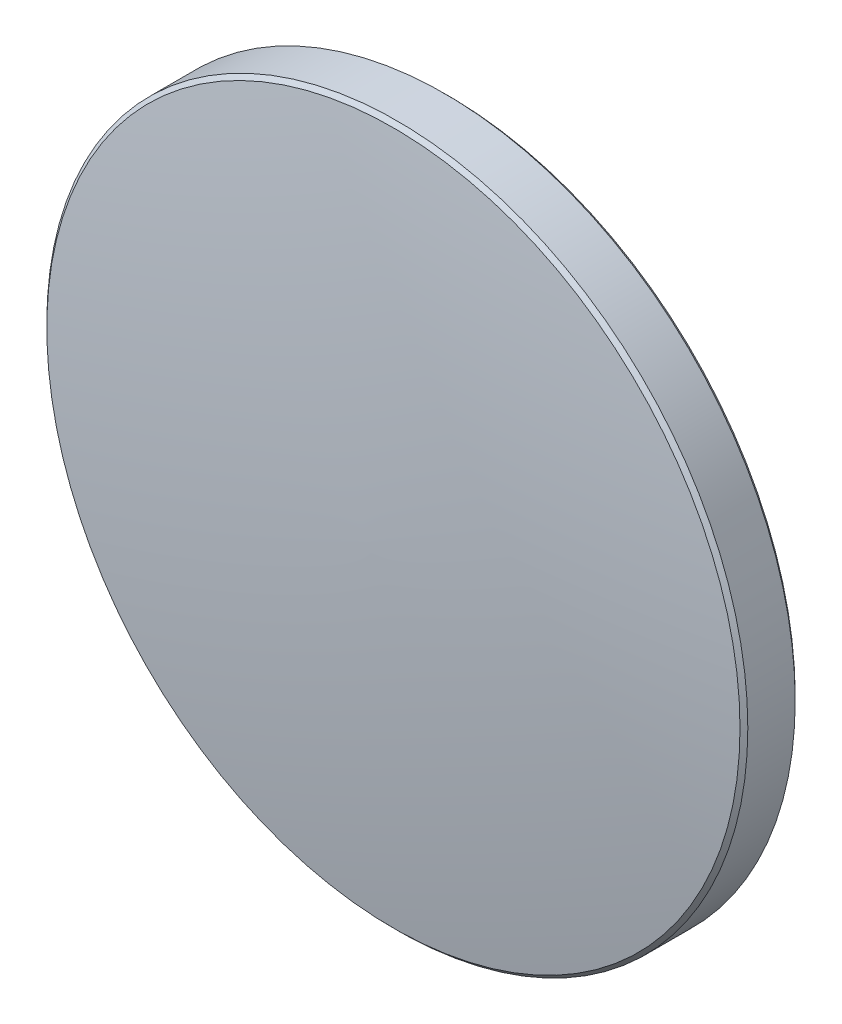
ISO-10303-21;
HEADER;
FILE_DESCRIPTION(('STEP AP214'),'2;1');
FILE_NAME('part.step','',(''),(''),'','','');
FILE_SCHEMA(('AUTOMOTIVE_DESIGN { 1 0 10303 214 1 1 1 1 }'));
ENDSEC;
DATA;
#1=APPLICATION_CONTEXT('core data for automotive mechanical design processes');
#2=APPLICATION_PROTOCOL_DEFINITION('international standard','automotive_design',2000,#1);
#3=PRODUCT_CONTEXT('',#1,'mechanical');
#4=PRODUCT('Part','Part','',(#3));
#5=PRODUCT_RELATED_PRODUCT_CATEGORY('part','',(#4));
#6=PRODUCT_DEFINITION_FORMATION('','',#4);
#7=PRODUCT_DEFINITION_CONTEXT('part definition',#1,'design');
#8=PRODUCT_DEFINITION('design','',#6,#7);
#9=PRODUCT_DEFINITION_SHAPE('','',#8);
#10=(LENGTH_UNIT() NAMED_UNIT(*) SI_UNIT(.MILLI.,.METRE.));
#11=(NAMED_UNIT(*) PLANE_ANGLE_UNIT() SI_UNIT($,.RADIAN.));
#12=(NAMED_UNIT(*) SI_UNIT($,.STERADIAN.) SOLID_ANGLE_UNIT());
#13=UNCERTAINTY_MEASURE_WITH_UNIT(LENGTH_MEASURE(1.E-05),#10,'distance_accuracy_value','');
#14=(GEOMETRIC_REPRESENTATION_CONTEXT(3) GLOBAL_UNCERTAINTY_ASSIGNED_CONTEXT((#13)) GLOBAL_UNIT_ASSIGNED_CONTEXT((#10,
#11,#12)) REPRESENTATION_CONTEXT('',''));
#15=CARTESIAN_POINT('',(0.,0.,0.));
#16=DIRECTION('',(0.,0.,1.));
#17=DIRECTION('',(1.,0.,0.));
#18=AXIS2_PLACEMENT_3D('',#15,#16,#17);
#19=CARTESIAN_POINT('',(-0.499048706813865,0.,-90.5337398495075));
#20=DIRECTION('',(0.,-1.,0.));
#21=DIRECTION('',(1.,0.,0.));
#22=AXIS2_PLACEMENT_3D('',#19,#20,#21);
#23=CIRCLE('',#22,92.);
#24=TRIMMED_CURVE('',#23,(PARAMETER_VALUE(-1.56537185772719)),
(PARAMETER_VALUE(1.56537185772719)),.T.,.PARAMETER.);
#25=CARTESIAN_POINT('',(0.,0.,-90.5337398495075));
#26=DIRECTION('',(0.,0.,1.));
#27=AXIS1_PLACEMENT('',#25,#26);
#28=SURFACE_OF_REVOLUTION('',#24,#27);
#29=CARTESIAN_POINT('',(0.,0.,1.46490661003678));
#30=VERTEX_POINT('',#29);
#31=VERTEX_LOOP('',#30);
#32=FACE_BOUND('',#31,.T.);
#33=CARTESIAN_POINT('',(0.,0.,0.534906610036778));
#34=DIRECTION('',(0.,0.,1.));
#35=DIRECTION('',(1.,0.,0.));
#36=AXIS2_PLACEMENT_3D('',#33,#34,#35);
#37=CIRCLE('',#36,12.5585786437627);
#38=CARTESIAN_POINT('',(12.5585786437627,0.,0.534906610036778));
#39=VERTEX_POINT('',#38);
#40=EDGE_CURVE('E30',#39,#39,#37,.T.);
#41=ORIENTED_EDGE('',*,*,#40,.T.);
#42=EDGE_LOOP('',(#41));
#43=FACE_BOUND('',#42,.T.);
#44=ADVANCED_FACE('F16',(#32,#43),#28,.T.);
#45=CARTESIAN_POINT('',(0.,0.,-1.46509338996322));
#46=DIRECTION('',(0.,0.,1.));
#47=DIRECTION('',(1.,0.,0.));
#48=AXIS2_PLACEMENT_3D('',#45,#46,#47);
#49=PLANE('',#48);
#50=CARTESIAN_POINT('',(0.,0.,-1.46509338996322));
#51=DIRECTION('',(0.,0.,1.));
#52=DIRECTION('',(1.,0.,0.));
#53=AXIS2_PLACEMENT_3D('',#50,#51,#52);
#54=CIRCLE('',#53,12.5585786437627);
#55=CARTESIAN_POINT('',(12.5585786437627,0.,-1.46509338996322));
#56=VERTEX_POINT('',#55);
#57=EDGE_CURVE('E10',#56,#56,#54,.T.);
#58=ORIENTED_EDGE('',*,*,#57,.F.);
#59=EDGE_LOOP('',(#58));
#60=FACE_BOUND('',#59,.T.);
#61=ADVANCED_FACE('F27',(#60),#49,.F.);
#62=CARTESIAN_POINT('',(0.,0.,-1.46509338996322));
#63=DIRECTION('',(0.,0.,1.));
#64=DIRECTION('',(1.,0.,0.));
#65=AXIS2_PLACEMENT_3D('',#62,#63,#64);
#66=CONICAL_SURFACE('',#65,12.5585786437627,0.785398163397448);
#67=CARTESIAN_POINT('',(0.,0.,-1.32367203372591));
#68=DIRECTION('',(0.,0.,1.));
#69=DIRECTION('',(1.,0.,0.));
#70=AXIS2_PLACEMENT_3D('',#67,#68,#69);
#71=CIRCLE('',#70,12.7);
#72=CARTESIAN_POINT('',(12.7,0.,-1.32367203372591));
#73=VERTEX_POINT('',#72);
#74=EDGE_CURVE('E22',#73,#73,#71,.T.);
#75=ORIENTED_EDGE('',*,*,#74,.F.);
#76=EDGE_LOOP('',(#75));
#77=FACE_BOUND('',#76,.T.);
#78=ORIENTED_EDGE('',*,*,#57,.T.);
#79=EDGE_LOOP('',(#78));
#80=FACE_BOUND('',#79,.T.);
#81=ADVANCED_FACE('F41',(#77,#80),#66,.T.);
#82=CARTESIAN_POINT('',(0.,0.,1.46490661003678));
#83=DIRECTION('',(0.,0.,1.));
#84=DIRECTION('',(1.,0.,0.));
#85=AXIS2_PLACEMENT_3D('',#82,#83,#84);
#86=CYLINDRICAL_SURFACE('',#85,12.7);
#87=CARTESIAN_POINT('',(0.,0.,0.393485253799468));
#88=DIRECTION('',(0.,0.,1.));
#89=DIRECTION('',(1.,0.,0.));
#90=AXIS2_PLACEMENT_3D('',#87,#88,#89);
#91=CIRCLE('',#90,12.7);
#92=CARTESIAN_POINT('',(12.7,0.,0.393485253799468));
#93=VERTEX_POINT('',#92);
#94=EDGE_CURVE('E32',#93,#93,#91,.T.);
#95=ORIENTED_EDGE('',*,*,#94,.F.);
#96=EDGE_LOOP('',(#95));
#97=FACE_BOUND('',#96,.T.);
#98=ORIENTED_EDGE('',*,*,#74,.T.);
#99=EDGE_LOOP('',(#98));
#100=FACE_BOUND('',#99,.T.);
#101=ADVANCED_FACE('F39',(#97,#100),#86,.T.);
#102=CARTESIAN_POINT('',(0.,0.,0.393485253799468));
#103=DIRECTION('',(0.,0.,-1.));
#104=DIRECTION('',(-1.,0.,0.));
#105=AXIS2_PLACEMENT_3D('',#102,#103,#104);
#106=CONICAL_SURFACE('',#105,12.7,0.785398163397447);
#107=ORIENTED_EDGE('',*,*,#40,.F.);
#108=EDGE_LOOP('',(#107));
#109=FACE_BOUND('',#108,.T.);
#110=ORIENTED_EDGE('',*,*,#94,.T.);
#111=EDGE_LOOP('',(#110));
#112=FACE_BOUND('',#111,.T.);
#113=ADVANCED_FACE('F54',(#109,#112),#106,.T.);
#114=CLOSED_SHELL('',(#44,#61,#81,#101,#113));
#115=MANIFOLD_SOLID_BREP('B1',#114);
#116=ADVANCED_BREP_SHAPE_REPRESENTATION('',(#18,#115),#14);
#117=SHAPE_DEFINITION_REPRESENTATION(#9,#116);
ENDSEC;
END-ISO-10303-21;
